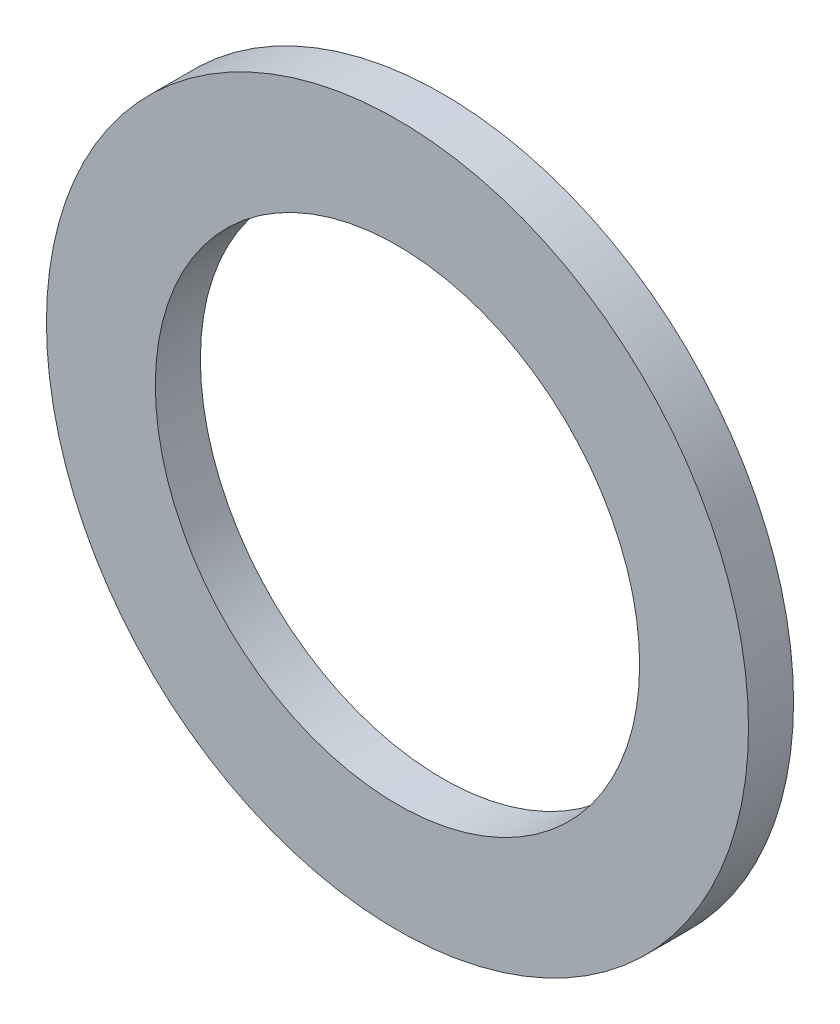
ISO-10303-21;
HEADER;
FILE_DESCRIPTION(('STEP AP214'),'2;1');
FILE_NAME('part.step','',(''),(''),'','','');
FILE_SCHEMA(('AUTOMOTIVE_DESIGN { 1 0 10303 214 1 1 1 1 }'));
ENDSEC;
DATA;
#1=APPLICATION_CONTEXT('core data for automotive mechanical design processes');
#2=APPLICATION_PROTOCOL_DEFINITION('international standard','automotive_design',2000,#1);
#3=PRODUCT_CONTEXT('',#1,'mechanical');
#4=PRODUCT('Part','Part','',(#3));
#5=PRODUCT_RELATED_PRODUCT_CATEGORY('part','',(#4));
#6=PRODUCT_DEFINITION_FORMATION('','',#4);
#7=PRODUCT_DEFINITION_CONTEXT('part definition',#1,'design');
#8=PRODUCT_DEFINITION('design','',#6,#7);
#9=PRODUCT_DEFINITION_SHAPE('','',#8);
#10=(LENGTH_UNIT() NAMED_UNIT(*) SI_UNIT(.MILLI.,.METRE.));
#11=(NAMED_UNIT(*) PLANE_ANGLE_UNIT() SI_UNIT($,.RADIAN.));
#12=(NAMED_UNIT(*) SI_UNIT($,.STERADIAN.) SOLID_ANGLE_UNIT());
#13=UNCERTAINTY_MEASURE_WITH_UNIT(LENGTH_MEASURE(1.E-05),#10,'distance_accuracy_value','');
#14=(GEOMETRIC_REPRESENTATION_CONTEXT(3) GLOBAL_UNCERTAINTY_ASSIGNED_CONTEXT((#13)) GLOBAL_UNIT_ASSIGNED_CONTEXT((#10,
#11,#12)) REPRESENTATION_CONTEXT('',''));
#15=CARTESIAN_POINT('',(0.,0.,0.));
#16=DIRECTION('',(0.,0.,1.));
#17=DIRECTION('',(1.,0.,0.));
#18=AXIS2_PLACEMENT_3D('',#15,#16,#17);
#19=CARTESIAN_POINT('',(0.,0.,0.3048));
#20=DIRECTION('',(0.,0.,1.));
#21=DIRECTION('',(1.,0.,0.));
#22=AXIS2_PLACEMENT_3D('',#19,#20,#21);
#23=PLANE('',#22);
#24=CARTESIAN_POINT('',(0.,0.,0.3048));
#25=DIRECTION('',(0.,0.,-1.));
#26=DIRECTION('',(-1.,0.,0.));
#27=AXIS2_PLACEMENT_3D('',#24,#25,#26);
#28=CIRCLE('',#27,1.6383);
#29=CARTESIAN_POINT('',(-1.6383,0.,0.3048));
#30=VERTEX_POINT('',#29);
#31=EDGE_CURVE('E26',#30,#30,#28,.T.);
#32=ORIENTED_EDGE('',*,*,#31,.T.);
#33=EDGE_LOOP('',(#32));
#34=FACE_BOUND('',#33,.T.);
#35=CARTESIAN_POINT('',(0.,0.,0.3048));
#36=DIRECTION('',(0.,0.,1.));
#37=DIRECTION('',(1.,0.,0.));
#38=AXIS2_PLACEMENT_3D('',#35,#36,#37);
#39=CIRCLE('',#38,2.3749);
#40=CARTESIAN_POINT('',(2.3749,0.,0.3048));
#41=VERTEX_POINT('',#40);
#42=EDGE_CURVE('E17',#41,#41,#39,.F.);
#43=ORIENTED_EDGE('',*,*,#42,.F.);
#44=EDGE_LOOP('',(#43));
#45=FACE_BOUND('',#44,.T.);
#46=ADVANCED_FACE('F14',(#34,#45),#23,.T.);
#47=CARTESIAN_POINT('',(0.,0.,0.));
#48=DIRECTION('',(0.,0.,1.));
#49=DIRECTION('',(1.,0.,0.));
#50=AXIS2_PLACEMENT_3D('',#47,#48,#49);
#51=CYLINDRICAL_SURFACE('',#50,2.3749);
#52=ORIENTED_EDGE('',*,*,#42,.T.);
#53=EDGE_LOOP('',(#52));
#54=FACE_BOUND('',#53,.T.);
#55=CARTESIAN_POINT('',(0.,0.,0.));
#56=DIRECTION('',(0.,0.,1.));
#57=DIRECTION('',(1.,0.,0.));
#58=AXIS2_PLACEMENT_3D('',#55,#56,#57);
#59=CIRCLE('',#58,2.3749);
#60=CARTESIAN_POINT('',(2.3749,0.,0.));
#61=VERTEX_POINT('',#60);
#62=EDGE_CURVE('E21',#61,#61,#59,.T.);
#63=ORIENTED_EDGE('',*,*,#62,.T.);
#64=EDGE_LOOP('',(#63));
#65=FACE_BOUND('',#64,.T.);
#66=ADVANCED_FACE('F34',(#54,#65),#51,.T.);
#67=CARTESIAN_POINT('',(0.,0.,0.));
#68=DIRECTION('',(0.,0.,-1.));
#69=DIRECTION('',(-1.,0.,0.));
#70=AXIS2_PLACEMENT_3D('',#67,#68,#69);
#71=CYLINDRICAL_SURFACE('',#70,1.6383);
#72=ORIENTED_EDGE('',*,*,#31,.F.);
#73=EDGE_LOOP('',(#72));
#74=FACE_BOUND('',#73,.T.);
#75=CARTESIAN_POINT('',(0.,0.,0.));
#76=DIRECTION('',(0.,0.,-1.));
#77=DIRECTION('',(-1.,0.,0.));
#78=AXIS2_PLACEMENT_3D('',#75,#76,#77);
#79=CIRCLE('',#78,1.6383);
#80=CARTESIAN_POINT('',(-1.6383,0.,0.));
#81=VERTEX_POINT('',#80);
#82=EDGE_CURVE('E10',#81,#81,#79,.T.);
#83=ORIENTED_EDGE('',*,*,#82,.T.);
#84=EDGE_LOOP('',(#83));
#85=FACE_BOUND('',#84,.T.);
#86=ADVANCED_FACE('F42',(#74,#85),#71,.F.);
#87=CARTESIAN_POINT('',(0.,0.,0.));
#88=DIRECTION('',(0.,0.,1.));
#89=DIRECTION('',(1.,0.,0.));
#90=AXIS2_PLACEMENT_3D('',#87,#88,#89);
#91=PLANE('',#90);
#92=ORIENTED_EDGE('',*,*,#82,.F.);
#93=EDGE_LOOP('',(#92));
#94=FACE_BOUND('',#93,.T.);
#95=ORIENTED_EDGE('',*,*,#62,.F.);
#96=EDGE_LOOP('',(#95));
#97=FACE_BOUND('',#96,.T.);
#98=ADVANCED_FACE('F43',(#94,#97),#91,.F.);
#99=CLOSED_SHELL('',(#46,#66,#86,#98));
#100=MANIFOLD_SOLID_BREP('B1',#99);
#101=ADVANCED_BREP_SHAPE_REPRESENTATION('',(#18,#100),#14);
#102=SHAPE_DEFINITION_REPRESENTATION(#9,#101);
ENDSEC;
END-ISO-10303-21;
